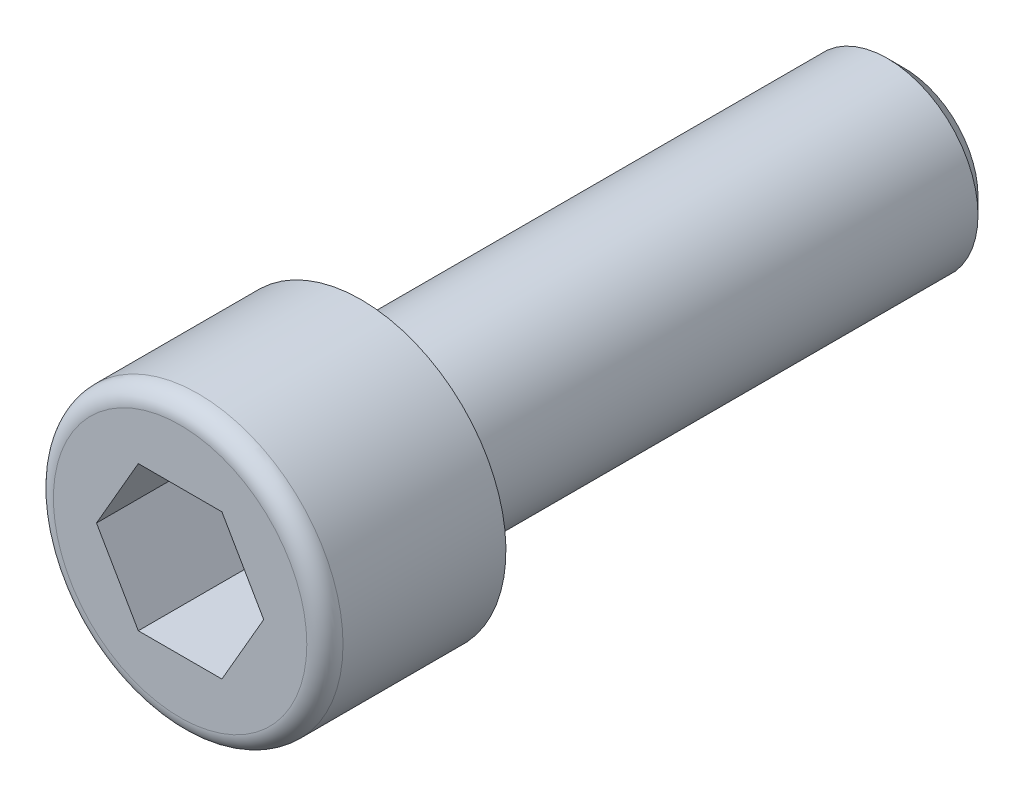
ISO-10303-21;
HEADER;
FILE_DESCRIPTION(('STEP AP214'),'2;1');
FILE_NAME('part.step','',(''),(''),'','','');
FILE_SCHEMA(('AUTOMOTIVE_DESIGN { 1 0 10303 214 1 1 1 1 }'));
ENDSEC;
DATA;
#1=APPLICATION_CONTEXT('core data for automotive mechanical design processes');
#2=APPLICATION_PROTOCOL_DEFINITION('international standard','automotive_design',2000,#1);
#3=PRODUCT_CONTEXT('',#1,'mechanical');
#4=PRODUCT('Part','Part','',(#3));
#5=PRODUCT_RELATED_PRODUCT_CATEGORY('part','',(#4));
#6=PRODUCT_DEFINITION_FORMATION('','',#4);
#7=PRODUCT_DEFINITION_CONTEXT('part definition',#1,'design');
#8=PRODUCT_DEFINITION('design','',#6,#7);
#9=PRODUCT_DEFINITION_SHAPE('','',#8);
#10=(LENGTH_UNIT() NAMED_UNIT(*) SI_UNIT(.MILLI.,.METRE.));
#11=(NAMED_UNIT(*) PLANE_ANGLE_UNIT() SI_UNIT($,.RADIAN.));
#12=(NAMED_UNIT(*) SI_UNIT($,.STERADIAN.) SOLID_ANGLE_UNIT());
#13=UNCERTAINTY_MEASURE_WITH_UNIT(LENGTH_MEASURE(1.E-05),#10,'distance_accuracy_value','');
#14=(GEOMETRIC_REPRESENTATION_CONTEXT(3) GLOBAL_UNCERTAINTY_ASSIGNED_CONTEXT((#13)) GLOBAL_UNIT_ASSIGNED_CONTEXT((#10,
#11,#12)) REPRESENTATION_CONTEXT('',''));
#15=CARTESIAN_POINT('',(0.,0.,0.));
#16=DIRECTION('',(0.,0.,1.));
#17=DIRECTION('',(1.,0.,0.));
#18=AXIS2_PLACEMENT_3D('',#15,#16,#17);
#19=CARTESIAN_POINT('',(0.,0.,2.35862251845746));
#20=DIRECTION('',(0.,0.,-1.));
#21=DIRECTION('',(0.,1.,0.));
#22=AXIS2_PLACEMENT_3D('',#19,#20,#21);
#23=PLANE('',#22);
#24=DIRECTION('',(0.500000000000001,-0.866025403784438,0.));
#25=VECTOR('',#24,1.);
#26=CARTESIAN_POINT('',(3.46410161513775,2.,2.35862251845746));
#27=LINE('',#26,#25);
#28=CARTESIAN_POINT('',(2.3094010767585,4.,2.35862251845746));
#29=VERTEX_POINT('',#28);
#30=CARTESIAN_POINT('',(4.61880215351701,0.,2.35862251845746));
#31=VERTEX_POINT('',#30);
#32=EDGE_CURVE('E72',#29,#31,#27,.T.);
#33=ORIENTED_EDGE('',*,*,#32,.F.);
#34=DIRECTION('',(1.,0.,0.));
#35=VECTOR('',#34,1.);
#36=CARTESIAN_POINT('',(0.,4.,2.35862251845746));
#37=LINE('',#36,#35);
#38=CARTESIAN_POINT('',(-2.3094010767585,4.,2.35862251845746));
#39=VERTEX_POINT('',#38);
#40=EDGE_CURVE('E221',#39,#29,#37,.T.);
#41=ORIENTED_EDGE('',*,*,#40,.F.);
#42=DIRECTION('',(0.5,0.866025403784439,0.));
#43=VECTOR('',#42,1.);
#44=CARTESIAN_POINT('',(-3.46410161513775,2.,2.35862251845746));
#45=LINE('',#44,#43);
#46=CARTESIAN_POINT('',(-4.61880215351701,0.,2.35862251845746));
#47=VERTEX_POINT('',#46);
#48=EDGE_CURVE('E224',#47,#39,#45,.T.);
#49=ORIENTED_EDGE('',*,*,#48,.F.);
#50=DIRECTION('',(-0.500000000000001,0.866025403784438,0.));
#51=VECTOR('',#50,1.);
#52=CARTESIAN_POINT('',(-3.46410161513775,-2.,2.35862251845746));
#53=LINE('',#52,#51);
#54=CARTESIAN_POINT('',(-2.3094010767585,-4.,2.35862251845746));
#55=VERTEX_POINT('',#54);
#56=EDGE_CURVE('E229',#55,#47,#53,.T.);
#57=ORIENTED_EDGE('',*,*,#56,.F.);
#58=DIRECTION('',(1.,0.,0.));
#59=VECTOR('',#58,1.);
#60=CARTESIAN_POINT('',(0.,-4.,2.35862251845746));
#61=LINE('',#60,#59);
#62=CARTESIAN_POINT('',(2.3094010767585,-4.,2.35862251845746));
#63=VERTEX_POINT('',#62);
#64=EDGE_CURVE('E83',#63,#55,#61,.F.);
#65=ORIENTED_EDGE('',*,*,#64,.F.);
#66=DIRECTION('',(-0.5,-0.866025403784439,0.));
#67=VECTOR('',#66,1.);
#68=CARTESIAN_POINT('',(3.46410161513775,-2.,2.35862251845746));
#69=LINE('',#68,#67);
#70=EDGE_CURVE('E67',#31,#63,#69,.T.);
#71=ORIENTED_EDGE('',*,*,#70,.F.);
#72=EDGE_LOOP('',(#33,#41,#49,#57,#65,#71));
#73=FACE_BOUND('',#72,.T.);
#74=ADVANCED_FACE('F17',(#73),#23,.F.);
#75=CARTESIAN_POINT('',(3.46410161513775,2.,6.17931125922873));
#76=DIRECTION('',(-0.866025403784438,-0.500000000000001,0.));
#77=DIRECTION('',(0.500000000000001,-0.866025403784438,0.));
#78=AXIS2_PLACEMENT_3D('',#75,#76,#77);
#79=PLANE('',#78);
#80=DIRECTION('',(0.,0.,1.));
#81=VECTOR('',#80,1.);
#82=CARTESIAN_POINT('',(4.61880215351701,0.,6.17931125922873));
#83=LINE('',#82,#81);
#84=CARTESIAN_POINT('',(4.61880215351701,0.,10.));
#85=VERTEX_POINT('',#84);
#86=EDGE_CURVE('E74',#85,#31,#83,.F.);
#87=ORIENTED_EDGE('',*,*,#86,.F.);
#88=DIRECTION('',(0.5,-0.866025403784438,0.));
#89=VECTOR('',#88,1.);
#90=CARTESIAN_POINT('',(2.3094010767585,4.,10.));
#91=LINE('',#90,#89);
#92=CARTESIAN_POINT('',(2.3094010767585,4.,10.));
#93=VERTEX_POINT('',#92);
#94=EDGE_CURVE('E210',#93,#85,#91,.T.);
#95=ORIENTED_EDGE('',*,*,#94,.F.);
#96=DIRECTION('',(0.,0.,-1.));
#97=VECTOR('',#96,1.);
#98=CARTESIAN_POINT('',(2.3094010767585,4.,6.17931125922873));
#99=LINE('',#98,#97);
#100=EDGE_CURVE('E77',#29,#93,#99,.F.);
#101=ORIENTED_EDGE('',*,*,#100,.F.);
#102=ORIENTED_EDGE('',*,*,#32,.T.);
#103=EDGE_LOOP('',(#87,#95,#101,#102));
#104=FACE_BOUND('',#103,.T.);
#105=ADVANCED_FACE('F73',(#104),#79,.T.);
#106=CARTESIAN_POINT('',(3.46410161513776,-2.,6.17931125922873));
#107=DIRECTION('',(-0.866025403784439,0.5,0.));
#108=DIRECTION('',(-0.5,-0.866025403784439,0.));
#109=AXIS2_PLACEMENT_3D('',#106,#107,#108);
#110=PLANE('',#109);
#111=DIRECTION('',(0.,0.,1.));
#112=VECTOR('',#111,1.);
#113=CARTESIAN_POINT('',(2.3094010767585,-4.,6.17931125922873));
#114=LINE('',#113,#112);
#115=CARTESIAN_POINT('',(2.3094010767585,-4.,10.));
#116=VERTEX_POINT('',#115);
#117=EDGE_CURVE('E85',#116,#63,#114,.F.);
#118=ORIENTED_EDGE('',*,*,#117,.F.);
#119=DIRECTION('',(-0.5,-0.866025403784439,0.));
#120=VECTOR('',#119,1.);
#121=CARTESIAN_POINT('',(4.61880215351701,0.,10.));
#122=LINE('',#121,#120);
#123=EDGE_CURVE('E89',#85,#116,#122,.T.);
#124=ORIENTED_EDGE('',*,*,#123,.F.);
#125=ORIENTED_EDGE('',*,*,#86,.T.);
#126=ORIENTED_EDGE('',*,*,#70,.T.);
#127=EDGE_LOOP('',(#118,#124,#125,#126));
#128=FACE_BOUND('',#127,.T.);
#129=ADVANCED_FACE('F87',(#128),#110,.T.);
#130=CARTESIAN_POINT('',(0.,-4.,6.17931125922873));
#131=DIRECTION('',(0.,1.,0.));
#132=DIRECTION('',(0.,0.,1.));
#133=AXIS2_PLACEMENT_3D('',#130,#131,#132);
#134=PLANE('',#133);
#135=DIRECTION('',(0.,0.,1.));
#136=VECTOR('',#135,1.);
#137=CARTESIAN_POINT('',(-2.3094010767585,-4.,6.17931125922873));
#138=LINE('',#137,#136);
#139=CARTESIAN_POINT('',(-2.3094010767585,-4.,10.));
#140=VERTEX_POINT('',#139);
#141=EDGE_CURVE('E231',#140,#55,#138,.F.);
#142=ORIENTED_EDGE('',*,*,#141,.F.);
#143=DIRECTION('',(1.,0.,0.));
#144=VECTOR('',#143,1.);
#145=CARTESIAN_POINT('',(0.,-4.,10.));
#146=LINE('',#145,#144);
#147=EDGE_CURVE('E236',#116,#140,#146,.F.);
#148=ORIENTED_EDGE('',*,*,#147,.F.);
#149=ORIENTED_EDGE('',*,*,#117,.T.);
#150=ORIENTED_EDGE('',*,*,#64,.T.);
#151=EDGE_LOOP('',(#142,#148,#149,#150));
#152=FACE_BOUND('',#151,.T.);
#153=ADVANCED_FACE('F149',(#152),#134,.T.);
#154=CARTESIAN_POINT('',(-3.46410161513775,-2.,6.17931125922873));
#155=DIRECTION('',(0.866025403784438,0.500000000000001,0.));
#156=DIRECTION('',(-0.500000000000001,0.866025403784438,0.));
#157=AXIS2_PLACEMENT_3D('',#154,#155,#156);
#158=PLANE('',#157);
#159=DIRECTION('',(0.,0.,1.));
#160=VECTOR('',#159,1.);
#161=CARTESIAN_POINT('',(-4.618802153517,0.,6.17931125922873));
#162=LINE('',#161,#160);
#163=CARTESIAN_POINT('',(-4.61880215351701,0.,10.));
#164=VERTEX_POINT('',#163);
#165=EDGE_CURVE('E226',#164,#47,#162,.F.);
#166=ORIENTED_EDGE('',*,*,#165,.F.);
#167=DIRECTION('',(-0.5,0.866025403784439,0.));
#168=VECTOR('',#167,1.);
#169=CARTESIAN_POINT('',(-2.3094010767585,-4.,10.));
#170=LINE('',#169,#168);
#171=EDGE_CURVE('E240',#140,#164,#170,.T.);
#172=ORIENTED_EDGE('',*,*,#171,.F.);
#173=ORIENTED_EDGE('',*,*,#141,.T.);
#174=ORIENTED_EDGE('',*,*,#56,.T.);
#175=EDGE_LOOP('',(#166,#172,#173,#174));
#176=FACE_BOUND('',#175,.T.);
#177=ADVANCED_FACE('F146',(#176),#158,.T.);
#178=CARTESIAN_POINT('',(-3.46410161513775,2.,6.17931125922873));
#179=DIRECTION('',(0.866025403784439,-0.5,0.));
#180=DIRECTION('',(0.5,0.866025403784439,0.));
#181=AXIS2_PLACEMENT_3D('',#178,#179,#180);
#182=PLANE('',#181);
#183=DIRECTION('',(0.,0.,-1.));
#184=VECTOR('',#183,1.);
#185=CARTESIAN_POINT('',(-2.3094010767585,4.,6.17931125922873));
#186=LINE('',#185,#184);
#187=CARTESIAN_POINT('',(-2.3094010767585,4.,10.));
#188=VERTEX_POINT('',#187);
#189=EDGE_CURVE('E35',#188,#39,#186,.T.);
#190=ORIENTED_EDGE('',*,*,#189,.F.);
#191=DIRECTION('',(0.499999999999999,0.866025403784439,0.));
#192=VECTOR('',#191,1.);
#193=CARTESIAN_POINT('',(-4.618802153517,0.,10.));
#194=LINE('',#193,#192);
#195=EDGE_CURVE('E245',#164,#188,#194,.T.);
#196=ORIENTED_EDGE('',*,*,#195,.F.);
#197=ORIENTED_EDGE('',*,*,#165,.T.);
#198=ORIENTED_EDGE('',*,*,#48,.T.);
#199=EDGE_LOOP('',(#190,#196,#197,#198));
#200=FACE_BOUND('',#199,.T.);
#201=ADVANCED_FACE('F142',(#200),#182,.T.);
#202=CARTESIAN_POINT('',(0.,4.,6.17931125922873));
#203=DIRECTION('',(0.,-1.,0.));
#204=DIRECTION('',(0.,0.,-1.));
#205=AXIS2_PLACEMENT_3D('',#202,#203,#204);
#206=PLANE('',#205);
#207=ORIENTED_EDGE('',*,*,#100,.T.);
#208=DIRECTION('',(1.,0.,0.));
#209=VECTOR('',#208,1.);
#210=CARTESIAN_POINT('',(0.,4.,10.));
#211=LINE('',#210,#209);
#212=EDGE_CURVE('E114',#188,#93,#211,.T.);
#213=ORIENTED_EDGE('',*,*,#212,.F.);
#214=ORIENTED_EDGE('',*,*,#189,.T.);
#215=ORIENTED_EDGE('',*,*,#40,.T.);
#216=EDGE_LOOP('',(#207,#213,#214,#215));
#217=FACE_BOUND('',#216,.T.);
#218=ADVANCED_FACE('F137',(#217),#206,.T.);
#219=CARTESIAN_POINT('',(0.,0.,10.));
#220=DIRECTION('',(0.,0.,1.));
#221=DIRECTION('',(0.,-1.,0.));
#222=AXIS2_PLACEMENT_3D('',#219,#220,#221);
#223=PLANE('',#222);
#224=CARTESIAN_POINT('',(0.,0.,10.));
#225=DIRECTION('',(0.,0.,-1.));
#226=DIRECTION('',(1.,0.,0.));
#227=AXIS2_PLACEMENT_3D('',#224,#225,#226);
#228=CIRCLE('',#227,7.);
#229=CARTESIAN_POINT('',(7.,0.,10.));
#230=VERTEX_POINT('',#229);
#231=EDGE_CURVE('E109',#230,#230,#228,.T.);
#232=ORIENTED_EDGE('',*,*,#231,.F.);
#233=EDGE_LOOP('',(#232));
#234=FACE_BOUND('',#233,.T.);
#235=ORIENTED_EDGE('',*,*,#195,.T.);
#236=ORIENTED_EDGE('',*,*,#212,.T.);
#237=ORIENTED_EDGE('',*,*,#94,.T.);
#238=ORIENTED_EDGE('',*,*,#123,.T.);
#239=ORIENTED_EDGE('',*,*,#147,.T.);
#240=ORIENTED_EDGE('',*,*,#171,.T.);
#241=EDGE_LOOP('',(#235,#236,#237,#238,#239,#240));
#242=FACE_BOUND('',#241,.T.);
#243=ADVANCED_FACE('F126',(#234,#242),#223,.T.);
#244=CARTESIAN_POINT('',(0.,0.,9.));
#245=DIRECTION('',(0.,0.,-1.));
#246=DIRECTION('',(1.,0.,0.));
#247=AXIS2_PLACEMENT_3D('',#244,#245,#246);
#248=TOROIDAL_SURFACE('',#247,7.,1.);
#249=CARTESIAN_POINT('',(0.,0.,9.));
#250=DIRECTION('',(0.,0.,-1.));
#251=DIRECTION('',(0.,1.,0.));
#252=AXIS2_PLACEMENT_3D('',#249,#250,#251);
#253=CIRCLE('',#252,8.);
#254=CARTESIAN_POINT('',(0.,8.,9.));
#255=VERTEX_POINT('',#254);
#256=EDGE_CURVE('E105',#255,#255,#253,.T.);
#257=ORIENTED_EDGE('',*,*,#256,.F.);
#258=EDGE_LOOP('',(#257));
#259=FACE_BOUND('',#258,.T.);
#260=ORIENTED_EDGE('',*,*,#231,.T.);
#261=EDGE_LOOP('',(#260));
#262=FACE_BOUND('',#261,.T.);
#263=ADVANCED_FACE('F136',(#259,#262),#248,.T.);
#264=CARTESIAN_POINT('',(0.,0.,4.5));
#265=DIRECTION('',(0.,0.,-1.));
#266=DIRECTION('',(0.,1.,0.));
#267=AXIS2_PLACEMENT_3D('',#264,#265,#266);
#268=CYLINDRICAL_SURFACE('',#267,8.);
#269=CARTESIAN_POINT('',(0.,0.,0.));
#270=DIRECTION('',(0.,0.,-1.));
#271=DIRECTION('',(0.,1.,0.));
#272=AXIS2_PLACEMENT_3D('',#269,#270,#271);
#273=CIRCLE('',#272,8.);
#274=CARTESIAN_POINT('',(0.,8.,0.));
#275=VERTEX_POINT('',#274);
#276=EDGE_CURVE('E20',#275,#275,#273,.T.);
#277=ORIENTED_EDGE('',*,*,#276,.F.);
#278=EDGE_LOOP('',(#277));
#279=FACE_BOUND('',#278,.T.);
#280=ORIENTED_EDGE('',*,*,#256,.T.);
#281=EDGE_LOOP('',(#280));
#282=FACE_BOUND('',#281,.T.);
#283=ADVANCED_FACE('F197',(#279,#282),#268,.T.);
#284=CARTESIAN_POINT('',(0.,0.,0.));
#285=DIRECTION('',(0.,0.,-1.));
#286=DIRECTION('',(0.,1.,0.));
#287=AXIS2_PLACEMENT_3D('',#284,#285,#286);
#288=PLANE('',#287);
#289=ORIENTED_EDGE('',*,*,#276,.T.);
#290=EDGE_LOOP('',(#289));
#291=FACE_BOUND('',#290,.T.);
#292=CARTESIAN_POINT('',(0.,0.,0.));
#293=DIRECTION('',(0.,0.,-1.));
#294=DIRECTION('',(1.,0.,0.));
#295=AXIS2_PLACEMENT_3D('',#292,#293,#294);
#296=CIRCLE('',#295,5.4);
#297=CARTESIAN_POINT('',(5.4,0.,0.));
#298=VERTEX_POINT('',#297);
#299=EDGE_CURVE('E95',#298,#298,#296,.F.);
#300=ORIENTED_EDGE('',*,*,#299,.T.);
#301=EDGE_LOOP('',(#300));
#302=FACE_BOUND('',#301,.T.);
#303=ADVANCED_FACE('F189',(#291,#302),#288,.T.);
#304=CARTESIAN_POINT('',(0.,0.,-30.));
#305=DIRECTION('',(0.,0.,1.));
#306=DIRECTION('',(0.,-1.,0.));
#307=AXIS2_PLACEMENT_3D('',#304,#305,#306);
#308=PLANE('',#307);
#309=CARTESIAN_POINT('',(0.,0.,-30.0000000000296));
#310=DIRECTION('',(0.,0.,1.));
#311=DIRECTION('',(1.,0.,0.));
#312=AXIS2_PLACEMENT_3D('',#309,#310,#311);
#313=CIRCLE('',#312,4.07984999998234);
#314=CARTESIAN_POINT('',(4.07984999998234,0.,-30.0000000000296));
#315=VERTEX_POINT('',#314);
#316=EDGE_CURVE('E93',#315,#315,#313,.T.);
#317=ORIENTED_EDGE('',*,*,#316,.F.);
#318=EDGE_LOOP('',(#317));
#319=FACE_BOUND('',#318,.T.);
#320=ADVANCED_FACE('F180',(#319),#308,.F.);
#321=CARTESIAN_POINT('',(0.,0.,-0.4));
#322=DIRECTION('',(0.,0.,-1.));
#323=DIRECTION('',(1.,0.,0.));
#324=AXIS2_PLACEMENT_3D('',#321,#322,#323);
#325=TOROIDAL_SURFACE('',#324,5.4,0.4);
#326=ORIENTED_EDGE('',*,*,#299,.F.);
#327=EDGE_LOOP('',(#326));
#328=FACE_BOUND('',#327,.T.);
#329=CARTESIAN_POINT('',(0.,0.,-0.399999999999999));
#330=DIRECTION('',(0.,0.,-1.));
#331=DIRECTION('',(0.,1.,0.));
#332=AXIS2_PLACEMENT_3D('',#329,#330,#331);
#333=CIRCLE('',#332,5.);
#334=CARTESIAN_POINT('',(0.,5.,-0.4));
#335=VERTEX_POINT('',#334);
#336=EDGE_CURVE('E26',#335,#335,#333,.T.);
#337=ORIENTED_EDGE('',*,*,#336,.F.);
#338=EDGE_LOOP('',(#337));
#339=FACE_BOUND('',#338,.T.);
#340=ADVANCED_FACE('F169',(#328,#339),#325,.F.);
#341=CARTESIAN_POINT('',(0.,0.,-29.0798500001301));
#342=DIRECTION('',(0.,0.,1.));
#343=DIRECTION('',(1.,0.,0.));
#344=AXIS2_PLACEMENT_3D('',#341,#342,#343);
#345=CONICAL_SURFACE('',#344,4.99999999988177,0.785398163397448);
#346=ORIENTED_EDGE('',*,*,#316,.T.);
#347=EDGE_LOOP('',(#346));
#348=FACE_BOUND('',#347,.T.);
#349=CARTESIAN_POINT('',(0.,0.,-29.07985));
#350=DIRECTION('',(0.,0.,-1.));
#351=DIRECTION('',(0.,1.,0.));
#352=AXIS2_PLACEMENT_3D('',#349,#350,#351);
#353=CIRCLE('',#352,5.);
#354=CARTESIAN_POINT('',(0.,5.,-29.07985));
#355=VERTEX_POINT('',#354);
#356=EDGE_CURVE('E11',#355,#355,#353,.F.);
#357=ORIENTED_EDGE('',*,*,#356,.F.);
#358=EDGE_LOOP('',(#357));
#359=FACE_BOUND('',#358,.T.);
#360=ADVANCED_FACE('F162',(#348,#359),#345,.T.);
#361=CARTESIAN_POINT('',(0.,0.,-14.539925));
#362=DIRECTION('',(0.,0.,-1.));
#363=DIRECTION('',(0.,1.,0.));
#364=AXIS2_PLACEMENT_3D('',#361,#362,#363);
#365=CYLINDRICAL_SURFACE('',#364,5.);
#366=ORIENTED_EDGE('',*,*,#336,.T.);
#367=EDGE_LOOP('',(#366));
#368=FACE_BOUND('',#367,.T.);
#369=ORIENTED_EDGE('',*,*,#356,.T.);
#370=EDGE_LOOP('',(#369));
#371=FACE_BOUND('',#370,.T.);
#372=ADVANCED_FACE('F160',(#368,#371),#365,.T.);
#373=CLOSED_SHELL('',(#74,#105,#129,#153,#177,#201,#218,#243,#263,#283,#303,#320,#340,#360,#372));
#374=CARTESIAN_POINT('',(0.,0.,0.));
#375=DIRECTION('',(0.,0.,-1.));
#376=DIRECTION('',(1.,0.,0.));
#377=AXIS2_PLACEMENT_3D('',#374,#375,#376);
#378=TOROIDAL_SURFACE('',#377,5.,0.1);
#379=ADVANCED_FACE('F173',(),#378,.F.);
#380=CLOSED_SHELL('',(#379));
#381=ORIENTED_CLOSED_SHELL('',*,#380,.T.);
#382=BREP_WITH_VOIDS('B1',#373,(#381));
#383=ADVANCED_BREP_SHAPE_REPRESENTATION('',(#18,#382),#14);
#384=SHAPE_DEFINITION_REPRESENTATION(#9,#383);
ENDSEC;
END-ISO-10303-21;
